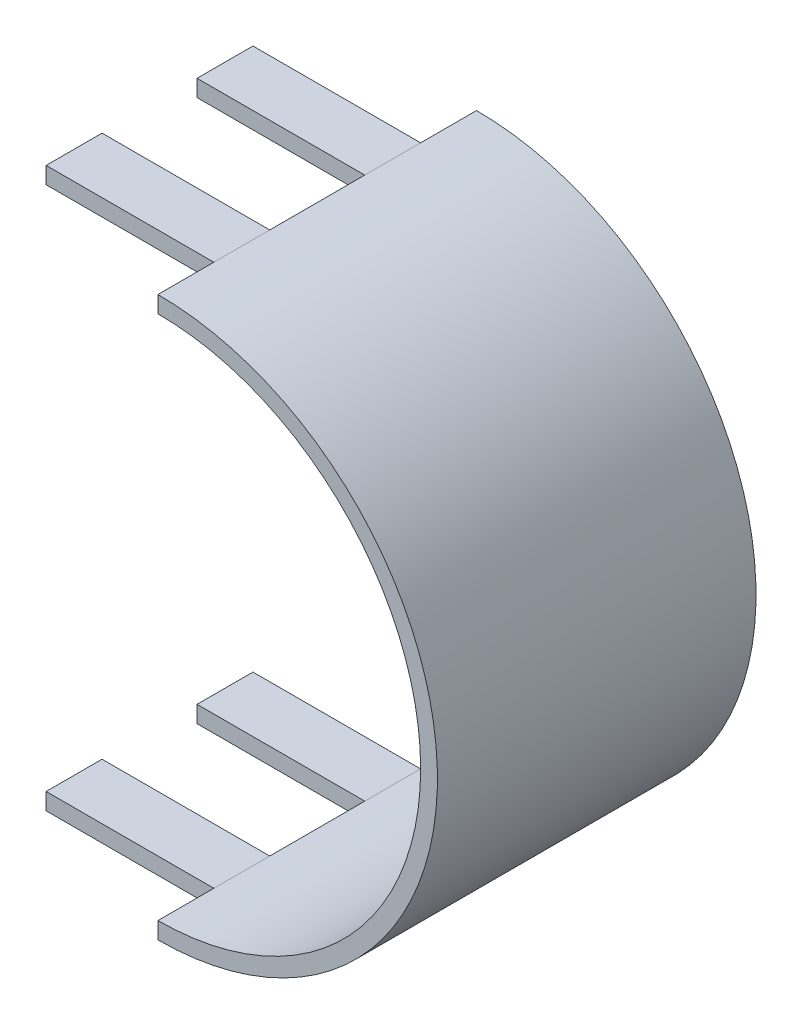
ISO-10303-21;
HEADER;
FILE_DESCRIPTION(('STEP AP214'),'2;1');
FILE_NAME('part.step','',(''),(''),'','','');
FILE_SCHEMA(('AUTOMOTIVE_DESIGN { 1 0 10303 214 1 1 1 1 }'));
ENDSEC;
DATA;
#1=APPLICATION_CONTEXT('core data for automotive mechanical design processes');
#2=APPLICATION_PROTOCOL_DEFINITION('international standard','automotive_design',2000,#1);
#3=PRODUCT_CONTEXT('',#1,'mechanical');
#4=PRODUCT('Part','Part','',(#3));
#5=PRODUCT_RELATED_PRODUCT_CATEGORY('part','',(#4));
#6=PRODUCT_DEFINITION_FORMATION('','',#4);
#7=PRODUCT_DEFINITION_CONTEXT('part definition',#1,'design');
#8=PRODUCT_DEFINITION('design','',#6,#7);
#9=PRODUCT_DEFINITION_SHAPE('','',#8);
#10=(LENGTH_UNIT() NAMED_UNIT(*) SI_UNIT(.MILLI.,.METRE.));
#11=(NAMED_UNIT(*) PLANE_ANGLE_UNIT() SI_UNIT($,.RADIAN.));
#12=(NAMED_UNIT(*) SI_UNIT($,.STERADIAN.) SOLID_ANGLE_UNIT());
#13=UNCERTAINTY_MEASURE_WITH_UNIT(LENGTH_MEASURE(1.E-05),#10,'distance_accuracy_value','');
#14=(GEOMETRIC_REPRESENTATION_CONTEXT(3) GLOBAL_UNCERTAINTY_ASSIGNED_CONTEXT((#13)) GLOBAL_UNIT_ASSIGNED_CONTEXT((#10,
#11,#12)) REPRESENTATION_CONTEXT('',''));
#15=CARTESIAN_POINT('',(0.,0.,0.));
#16=DIRECTION('',(0.,0.,1.));
#17=DIRECTION('',(1.,0.,0.));
#18=AXIS2_PLACEMENT_3D('',#15,#16,#17);
#19=CARTESIAN_POINT('',(300.,0.,60.));
#20=DIRECTION('',(0.,0.,-1.));
#21=DIRECTION('',(-1.,0.,0.));
#22=AXIS2_PLACEMENT_3D('',#19,#20,#21);
#23=CYLINDRICAL_SURFACE('',#22,50.);
#24=DIRECTION('',(0.,0.,-1.));
#25=VECTOR('',#24,1.);
#26=CARTESIAN_POINT('',(300.,-50.,60.));
#27=LINE('',#26,#25);
#28=CARTESIAN_POINT('',(300.,-50.,60.));
#29=VERTEX_POINT('',#28);
#30=CARTESIAN_POINT('',(300.,-50.,50.));
#31=VERTEX_POINT('',#30);
#32=EDGE_CURVE('E313',#29,#31,#27,.T.);
#33=ORIENTED_EDGE('',*,*,#32,.T.);
#34=DIRECTION('',(0.,0.,-1.));
#35=VECTOR('',#34,1.);
#36=CARTESIAN_POINT('',(300.,-50.,60.));
#37=LINE('',#36,#35);
#38=CARTESIAN_POINT('',(300.,-50.,40.));
#39=VERTEX_POINT('',#38);
#40=EDGE_CURVE('E249',#31,#39,#37,.T.);
#41=ORIENTED_EDGE('',*,*,#40,.T.);
#42=CARTESIAN_POINT('',(300.,-50.,23.));
#43=VERTEX_POINT('',#42);
#44=EDGE_CURVE('E323',#39,#43,#27,.T.);
#45=ORIENTED_EDGE('',*,*,#44,.T.);
#46=DIRECTION('',(0.,0.,-1.));
#47=VECTOR('',#46,1.);
#48=CARTESIAN_POINT('',(300.,-50.,60.));
#49=LINE('',#48,#47);
#50=CARTESIAN_POINT('',(300.,-50.,13.));
#51=VERTEX_POINT('',#50);
#52=EDGE_CURVE('E211',#43,#51,#49,.T.);
#53=ORIENTED_EDGE('',*,*,#52,.T.);
#54=CARTESIAN_POINT('',(300.,-50.,3.));
#55=VERTEX_POINT('',#54);
#56=EDGE_CURVE('E324',#51,#55,#27,.T.);
#57=ORIENTED_EDGE('',*,*,#56,.T.);
#58=CARTESIAN_POINT('',(300.,0.,3.));
#59=DIRECTION('',(0.,0.,1.));
#60=DIRECTION('',(1.,0.,0.));
#61=AXIS2_PLACEMENT_3D('',#58,#59,#60);
#62=CIRCLE('',#61,50.);
#63=CARTESIAN_POINT('',(300.,50.,3.));
#64=VERTEX_POINT('',#63);
#65=EDGE_CURVE('E317',#55,#64,#62,.T.);
#66=ORIENTED_EDGE('',*,*,#65,.T.);
#67=DIRECTION('',(0.,0.,-1.));
#68=VECTOR('',#67,1.);
#69=CARTESIAN_POINT('',(300.,50.,60.));
#70=LINE('',#69,#68);
#71=CARTESIAN_POINT('',(300.,50.,13.));
#72=VERTEX_POINT('',#71);
#73=EDGE_CURVE('E181',#72,#64,#70,.T.);
#74=ORIENTED_EDGE('',*,*,#73,.F.);
#75=DIRECTION('',(0.,0.,-1.));
#76=VECTOR('',#75,1.);
#77=CARTESIAN_POINT('',(300.,50.,60.));
#78=LINE('',#77,#76);
#79=CARTESIAN_POINT('',(300.,50.,23.));
#80=VERTEX_POINT('',#79);
#81=EDGE_CURVE('E185',#80,#72,#78,.T.);
#82=ORIENTED_EDGE('',*,*,#81,.F.);
#83=CARTESIAN_POINT('',(300.,50.,40.));
#84=VERTEX_POINT('',#83);
#85=EDGE_CURVE('E172',#84,#80,#70,.T.);
#86=ORIENTED_EDGE('',*,*,#85,.F.);
#87=DIRECTION('',(0.,0.,-1.));
#88=VECTOR('',#87,1.);
#89=CARTESIAN_POINT('',(300.,50.,60.));
#90=LINE('',#89,#88);
#91=CARTESIAN_POINT('',(300.,50.,50.));
#92=VERTEX_POINT('',#91);
#93=EDGE_CURVE('E287',#92,#84,#90,.T.);
#94=ORIENTED_EDGE('',*,*,#93,.F.);
#95=CARTESIAN_POINT('',(300.,50.,60.));
#96=VERTEX_POINT('',#95);
#97=EDGE_CURVE('E180',#96,#92,#70,.T.);
#98=ORIENTED_EDGE('',*,*,#97,.F.);
#99=CARTESIAN_POINT('',(300.,0.,60.));
#100=DIRECTION('',(0.,0.,1.));
#101=DIRECTION('',(1.,0.,0.));
#102=AXIS2_PLACEMENT_3D('',#99,#100,#101);
#103=CIRCLE('',#102,50.);
#104=EDGE_CURVE('E310',#29,#96,#103,.T.);
#105=ORIENTED_EDGE('',*,*,#104,.F.);
#106=EDGE_LOOP('',(#33,#41,#45,#53,#57,#66,#74,#82,#86,#94,#98,#105));
#107=FACE_BOUND('',#106,.T.);
#108=ADVANCED_FACE('F34',(#107),#23,.T.);
#109=CARTESIAN_POINT('',(300.,47.,3.));
#110=DIRECTION('',(0.,1.,0.));
#111=DIRECTION('',(0.,0.,1.));
#112=AXIS2_PLACEMENT_3D('',#109,#110,#111);
#113=PLANE('',#112);
#114=DIRECTION('',(-1.,0.,0.));
#115=VECTOR('',#114,1.);
#116=CARTESIAN_POINT('',(300.,47.,13.));
#117=LINE('',#116,#115);
#118=CARTESIAN_POINT('',(300.,47.,13.));
#119=VERTEX_POINT('',#118);
#120=CARTESIAN_POINT('',(270.,47.,13.));
#121=VERTEX_POINT('',#120);
#122=EDGE_CURVE('E192',#119,#121,#117,.T.);
#123=ORIENTED_EDGE('',*,*,#122,.F.);
#124=DIRECTION('',(0.,0.,1.));
#125=VECTOR('',#124,1.);
#126=CARTESIAN_POINT('',(300.,47.,3.));
#127=LINE('',#126,#125);
#128=CARTESIAN_POINT('',(300.,47.,23.));
#129=VERTEX_POINT('',#128);
#130=EDGE_CURVE('E58',#119,#129,#127,.T.);
#131=ORIENTED_EDGE('',*,*,#130,.T.);
#132=DIRECTION('',(1.,0.,0.));
#133=VECTOR('',#132,1.);
#134=CARTESIAN_POINT('',(300.,47.,23.));
#135=LINE('',#134,#133);
#136=CARTESIAN_POINT('',(270.,47.,23.));
#137=VERTEX_POINT('',#136);
#138=EDGE_CURVE('E206',#137,#129,#135,.T.);
#139=ORIENTED_EDGE('',*,*,#138,.F.);
#140=DIRECTION('',(0.,0.,1.));
#141=VECTOR('',#140,1.);
#142=CARTESIAN_POINT('',(270.,47.,3.));
#143=LINE('',#142,#141);
#144=EDGE_CURVE('E498',#121,#137,#143,.T.);
#145=ORIENTED_EDGE('',*,*,#144,.F.);
#146=EDGE_LOOP('',(#123,#131,#139,#145));
#147=FACE_BOUND('',#146,.T.);
#148=ADVANCED_FACE('F399',(#147),#113,.F.);
#149=CARTESIAN_POINT('',(300.,47.,3.));
#150=DIRECTION('',(0.,1.,0.));
#151=DIRECTION('',(0.,0.,1.));
#152=AXIS2_PLACEMENT_3D('',#149,#150,#151);
#153=PLANE('',#152);
#154=DIRECTION('',(-1.,0.,0.));
#155=VECTOR('',#154,1.);
#156=CARTESIAN_POINT('',(300.,47.,40.));
#157=LINE('',#156,#155);
#158=CARTESIAN_POINT('',(300.,47.,40.));
#159=VERTEX_POINT('',#158);
#160=CARTESIAN_POINT('',(270.,47.,40.));
#161=VERTEX_POINT('',#160);
#162=EDGE_CURVE('E289',#159,#161,#157,.T.);
#163=ORIENTED_EDGE('',*,*,#162,.F.);
#164=DIRECTION('',(0.,0.,1.));
#165=VECTOR('',#164,1.);
#166=CARTESIAN_POINT('',(300.,47.,3.));
#167=LINE('',#166,#165);
#168=CARTESIAN_POINT('',(300.,47.,50.));
#169=VERTEX_POINT('',#168);
#170=EDGE_CURVE('E282',#159,#169,#167,.T.);
#171=ORIENTED_EDGE('',*,*,#170,.T.);
#172=DIRECTION('',(1.,0.,0.));
#173=VECTOR('',#172,1.);
#174=CARTESIAN_POINT('',(300.,47.,50.));
#175=LINE('',#174,#173);
#176=CARTESIAN_POINT('',(270.,47.,50.));
#177=VERTEX_POINT('',#176);
#178=EDGE_CURVE('E295',#177,#169,#175,.T.);
#179=ORIENTED_EDGE('',*,*,#178,.F.);
#180=DIRECTION('',(0.,0.,1.));
#181=VECTOR('',#180,1.);
#182=CARTESIAN_POINT('',(270.,47.,3.));
#183=LINE('',#182,#181);
#184=EDGE_CURVE('E292',#161,#177,#183,.T.);
#185=ORIENTED_EDGE('',*,*,#184,.F.);
#186=EDGE_LOOP('',(#163,#171,#179,#185));
#187=FACE_BOUND('',#186,.T.);
#188=ADVANCED_FACE('F382',(#187),#153,.F.);
#189=CARTESIAN_POINT('',(-300.,-47.,3.));
#190=DIRECTION('',(0.,-1.,0.));
#191=DIRECTION('',(0.,0.,-1.));
#192=AXIS2_PLACEMENT_3D('',#189,#190,#191);
#193=PLANE('',#192);
#194=DIRECTION('',(1.,0.,0.));
#195=VECTOR('',#194,1.);
#196=CARTESIAN_POINT('',(-300.,-47.,40.));
#197=LINE('',#196,#195);
#198=CARTESIAN_POINT('',(270.,-47.,40.));
#199=VERTEX_POINT('',#198);
#200=CARTESIAN_POINT('',(300.,-47.,40.));
#201=VERTEX_POINT('',#200);
#202=EDGE_CURVE('E264',#199,#201,#197,.T.);
#203=ORIENTED_EDGE('',*,*,#202,.F.);
#204=DIRECTION('',(0.,0.,-1.));
#205=VECTOR('',#204,1.);
#206=CARTESIAN_POINT('',(270.,-47.,3.));
#207=LINE('',#206,#205);
#208=CARTESIAN_POINT('',(270.,-47.,50.));
#209=VERTEX_POINT('',#208);
#210=EDGE_CURVE('E261',#209,#199,#207,.T.);
#211=ORIENTED_EDGE('',*,*,#210,.F.);
#212=DIRECTION('',(-1.,0.,0.));
#213=VECTOR('',#212,1.);
#214=CARTESIAN_POINT('',(-300.,-47.,50.));
#215=LINE('',#214,#213);
#216=CARTESIAN_POINT('',(300.,-47.,50.));
#217=VERTEX_POINT('',#216);
#218=EDGE_CURVE('E260',#217,#209,#215,.T.);
#219=ORIENTED_EDGE('',*,*,#218,.F.);
#220=DIRECTION('',(0.,0.,1.));
#221=VECTOR('',#220,1.);
#222=CARTESIAN_POINT('',(300.,-47.,3.));
#223=LINE('',#222,#221);
#224=EDGE_CURVE('E246',#201,#217,#223,.T.);
#225=ORIENTED_EDGE('',*,*,#224,.F.);
#226=EDGE_LOOP('',(#203,#211,#219,#225));
#227=FACE_BOUND('',#226,.T.);
#228=ADVANCED_FACE('F436',(#227),#193,.F.);
#229=CARTESIAN_POINT('',(-300.,-47.,3.));
#230=DIRECTION('',(0.,-1.,0.));
#231=DIRECTION('',(0.,0.,-1.));
#232=AXIS2_PLACEMENT_3D('',#229,#230,#231);
#233=PLANE('',#232);
#234=DIRECTION('',(1.,0.,0.));
#235=VECTOR('',#234,1.);
#236=CARTESIAN_POINT('',(-300.,-47.,13.));
#237=LINE('',#236,#235);
#238=CARTESIAN_POINT('',(270.,-47.,13.));
#239=VERTEX_POINT('',#238);
#240=CARTESIAN_POINT('',(300.,-47.,13.));
#241=VERTEX_POINT('',#240);
#242=EDGE_CURVE('E231',#239,#241,#237,.T.);
#243=ORIENTED_EDGE('',*,*,#242,.F.);
#244=DIRECTION('',(0.,0.,-1.));
#245=VECTOR('',#244,1.);
#246=CARTESIAN_POINT('',(270.,-47.,3.));
#247=LINE('',#246,#245);
#248=CARTESIAN_POINT('',(270.,-47.,23.));
#249=VERTEX_POINT('',#248);
#250=EDGE_CURVE('E228',#249,#239,#247,.T.);
#251=ORIENTED_EDGE('',*,*,#250,.F.);
#252=DIRECTION('',(-1.,0.,0.));
#253=VECTOR('',#252,1.);
#254=CARTESIAN_POINT('',(-300.,-47.,23.));
#255=LINE('',#254,#253);
#256=CARTESIAN_POINT('',(300.,-47.,23.));
#257=VERTEX_POINT('',#256);
#258=EDGE_CURVE('E225',#257,#249,#255,.T.);
#259=ORIENTED_EDGE('',*,*,#258,.F.);
#260=DIRECTION('',(0.,0.,1.));
#261=VECTOR('',#260,1.);
#262=CARTESIAN_POINT('',(300.,-47.,3.));
#263=LINE('',#262,#261);
#264=EDGE_CURVE('E215',#241,#257,#263,.T.);
#265=ORIENTED_EDGE('',*,*,#264,.F.);
#266=EDGE_LOOP('',(#243,#251,#259,#265));
#267=FACE_BOUND('',#266,.T.);
#268=ADVANCED_FACE('F348',(#267),#233,.F.);
#269=CARTESIAN_POINT('',(270.,-50.01,13.));
#270=DIRECTION('',(-1.,0.,0.));
#271=DIRECTION('',(0.,0.,1.));
#272=AXIS2_PLACEMENT_3D('',#269,#270,#271);
#273=PLANE('',#272);
#274=DIRECTION('',(0.,1.,0.));
#275=VECTOR('',#274,1.);
#276=CARTESIAN_POINT('',(270.,-50.01,13.));
#277=LINE('',#276,#275);
#278=CARTESIAN_POINT('',(270.,-50.,13.));
#279=VERTEX_POINT('',#278);
#280=EDGE_CURVE('E214',#279,#239,#277,.T.);
#281=ORIENTED_EDGE('',*,*,#280,.F.);
#282=DIRECTION('',(0.,0.,1.));
#283=VECTOR('',#282,1.);
#284=CARTESIAN_POINT('',(270.,-50.,60.));
#285=LINE('',#284,#283);
#286=CARTESIAN_POINT('',(270.,-50.,23.));
#287=VERTEX_POINT('',#286);
#288=EDGE_CURVE('E237',#279,#287,#285,.T.);
#289=ORIENTED_EDGE('',*,*,#288,.T.);
#290=DIRECTION('',(0.,1.,0.));
#291=VECTOR('',#290,1.);
#292=CARTESIAN_POINT('',(270.,-50.01,23.));
#293=LINE('',#292,#291);
#294=EDGE_CURVE('E243',#287,#249,#293,.T.);
#295=ORIENTED_EDGE('',*,*,#294,.T.);
#296=ORIENTED_EDGE('',*,*,#250,.T.);
#297=EDGE_LOOP('',(#281,#289,#295,#296));
#298=FACE_BOUND('',#297,.T.);
#299=ADVANCED_FACE('F469',(#298),#273,.T.);
#300=CARTESIAN_POINT('',(300.,-50.01,23.));
#301=DIRECTION('',(0.,0.,1.));
#302=DIRECTION('',(1.,0.,0.));
#303=AXIS2_PLACEMENT_3D('',#300,#301,#302);
#304=PLANE('',#303);
#305=ORIENTED_EDGE('',*,*,#294,.F.);
#306=DIRECTION('',(1.,0.,0.));
#307=VECTOR('',#306,1.);
#308=CARTESIAN_POINT('',(-300.,-50.,23.));
#309=LINE('',#308,#307);
#310=EDGE_CURVE('E234',#287,#43,#309,.T.);
#311=ORIENTED_EDGE('',*,*,#310,.T.);
#312=DIRECTION('',(0.,1.,0.));
#313=VECTOR('',#312,1.);
#314=CARTESIAN_POINT('',(300.,1.71683972880179E-13,23.));
#315=LINE('',#314,#313);
#316=EDGE_CURVE('E218',#43,#257,#315,.T.);
#317=ORIENTED_EDGE('',*,*,#316,.T.);
#318=ORIENTED_EDGE('',*,*,#258,.T.);
#319=EDGE_LOOP('',(#305,#311,#317,#318));
#320=FACE_BOUND('',#319,.T.);
#321=ADVANCED_FACE('F432',(#320),#304,.T.);
#322=CARTESIAN_POINT('',(300.,-50.01,13.));
#323=DIRECTION('',(0.,0.,-1.));
#324=DIRECTION('',(-1.,0.,0.));
#325=AXIS2_PLACEMENT_3D('',#322,#323,#324);
#326=PLANE('',#325);
#327=DIRECTION('',(0.,-1.,0.));
#328=VECTOR('',#327,1.);
#329=CARTESIAN_POINT('',(300.,1.71683972880179E-13,13.));
#330=LINE('',#329,#328);
#331=EDGE_CURVE('E221',#241,#51,#330,.T.);
#332=ORIENTED_EDGE('',*,*,#331,.T.);
#333=DIRECTION('',(-1.,0.,0.));
#334=VECTOR('',#333,1.);
#335=CARTESIAN_POINT('',(-300.,-50.,13.));
#336=LINE('',#335,#334);
#337=EDGE_CURVE('E217',#51,#279,#336,.T.);
#338=ORIENTED_EDGE('',*,*,#337,.T.);
#339=ORIENTED_EDGE('',*,*,#280,.T.);
#340=ORIENTED_EDGE('',*,*,#242,.T.);
#341=EDGE_LOOP('',(#332,#338,#339,#340));
#342=FACE_BOUND('',#341,.T.);
#343=ADVANCED_FACE('F343',(#342),#326,.T.);
#344=CARTESIAN_POINT('',(-300.,-50.,60.));
#345=DIRECTION('',(0.,1.,0.));
#346=DIRECTION('',(0.,0.,1.));
#347=AXIS2_PLACEMENT_3D('',#344,#345,#346);
#348=PLANE('',#347);
#349=ORIENTED_EDGE('',*,*,#337,.F.);
#350=ORIENTED_EDGE('',*,*,#52,.F.);
#351=ORIENTED_EDGE('',*,*,#310,.F.);
#352=ORIENTED_EDGE('',*,*,#288,.F.);
#353=EDGE_LOOP('',(#349,#350,#351,#352));
#354=FACE_BOUND('',#353,.T.);
#355=ADVANCED_FACE('F420',(#354),#348,.F.);
#356=CARTESIAN_POINT('',(300.,1.71683972880179E-13,0.));
#357=DIRECTION('',(-1.,0.,0.));
#358=DIRECTION('',(0.,-1.,0.));
#359=AXIS2_PLACEMENT_3D('',#356,#357,#358);
#360=PLANE('',#359);
#361=ORIENTED_EDGE('',*,*,#331,.F.);
#362=DIRECTION('',(0.,0.,1.));
#363=VECTOR('',#362,1.);
#364=CARTESIAN_POINT('',(300.,-47.,3.));
#365=LINE('',#364,#363);
#366=CARTESIAN_POINT('',(300.,-47.,3.));
#367=VERTEX_POINT('',#366);
#368=EDGE_CURVE('E318',#367,#241,#365,.T.);
#369=ORIENTED_EDGE('',*,*,#368,.F.);
#370=DIRECTION('',(0.,1.,0.));
#371=VECTOR('',#370,1.);
#372=CARTESIAN_POINT('',(300.,1.71683972880179E-13,3.));
#373=LINE('',#372,#371);
#374=EDGE_CURVE('E11',#55,#367,#373,.T.);
#375=ORIENTED_EDGE('',*,*,#374,.F.);
#376=ORIENTED_EDGE('',*,*,#56,.F.);
#377=EDGE_LOOP('',(#361,#369,#375,#376));
#378=FACE_BOUND('',#377,.T.);
#379=ADVANCED_FACE('F341',(#378),#360,.T.);
#380=CARTESIAN_POINT('',(0.,0.,3.));
#381=DIRECTION('',(0.,0.,1.));
#382=DIRECTION('',(1.,0.,0.));
#383=AXIS2_PLACEMENT_3D('',#380,#381,#382);
#384=PLANE('',#383);
#385=DIRECTION('',(0.,1.,0.));
#386=VECTOR('',#385,1.);
#387=CARTESIAN_POINT('',(300.,1.71683972880179E-13,3.));
#388=LINE('',#387,#386);
#389=CARTESIAN_POINT('',(300.,47.,3.));
#390=VERTEX_POINT('',#389);
#391=EDGE_CURVE('E43',#390,#64,#388,.T.);
#392=ORIENTED_EDGE('',*,*,#391,.T.);
#393=ORIENTED_EDGE('',*,*,#65,.F.);
#394=ORIENTED_EDGE('',*,*,#374,.T.);
#395=CARTESIAN_POINT('',(300.,0.,3.));
#396=DIRECTION('',(0.,0.,1.));
#397=DIRECTION('',(1.,0.,0.));
#398=AXIS2_PLACEMENT_3D('',#395,#396,#397);
#399=CIRCLE('',#398,47.);
#400=EDGE_CURVE('E38',#390,#367,#399,.F.);
#401=ORIENTED_EDGE('',*,*,#400,.F.);
#402=EDGE_LOOP('',(#392,#393,#394,#401));
#403=FACE_BOUND('',#402,.T.);
#404=ADVANCED_FACE('F36',(#403),#384,.F.);
#405=CARTESIAN_POINT('',(300.,0.,3.));
#406=DIRECTION('',(0.,0.,1.));
#407=DIRECTION('',(1.,0.,0.));
#408=AXIS2_PLACEMENT_3D('',#405,#406,#407);
#409=CYLINDRICAL_SURFACE('',#408,47.);
#410=DIRECTION('',(0.,0.,1.));
#411=VECTOR('',#410,1.);
#412=CARTESIAN_POINT('',(300.,47.,3.));
#413=LINE('',#412,#411);
#414=EDGE_CURVE('E325',#390,#119,#413,.T.);
#415=ORIENTED_EDGE('',*,*,#414,.F.);
#416=ORIENTED_EDGE('',*,*,#400,.T.);
#417=ORIENTED_EDGE('',*,*,#368,.T.);
#418=ORIENTED_EDGE('',*,*,#264,.T.);
#419=EDGE_CURVE('E321',#257,#201,#365,.T.);
#420=ORIENTED_EDGE('',*,*,#419,.T.);
#421=ORIENTED_EDGE('',*,*,#224,.T.);
#422=CARTESIAN_POINT('',(300.,-47.,60.));
#423=VERTEX_POINT('',#422);
#424=EDGE_CURVE('E312',#217,#423,#365,.T.);
#425=ORIENTED_EDGE('',*,*,#424,.T.);
#426=CARTESIAN_POINT('',(300.,0.,60.));
#427=DIRECTION('',(0.,0.,1.));
#428=DIRECTION('',(1.,0.,0.));
#429=AXIS2_PLACEMENT_3D('',#426,#427,#428);
#430=CIRCLE('',#429,47.);
#431=CARTESIAN_POINT('',(300.,47.,60.));
#432=VERTEX_POINT('',#431);
#433=EDGE_CURVE('E314',#423,#432,#430,.T.);
#434=ORIENTED_EDGE('',*,*,#433,.T.);
#435=EDGE_CURVE('E284',#169,#432,#413,.T.);
#436=ORIENTED_EDGE('',*,*,#435,.F.);
#437=ORIENTED_EDGE('',*,*,#170,.F.);
#438=EDGE_CURVE('E326',#129,#159,#413,.T.);
#439=ORIENTED_EDGE('',*,*,#438,.F.);
#440=ORIENTED_EDGE('',*,*,#130,.F.);
#441=EDGE_LOOP('',(#415,#416,#417,#418,#420,#421,#425,#434,#436,#437,#439,#440));
#442=FACE_BOUND('',#441,.T.);
#443=ADVANCED_FACE('F336',(#442),#409,.F.);
#444=CARTESIAN_POINT('',(-300.,0.,60.));
#445=DIRECTION('',(0.,0.,1.));
#446=DIRECTION('',(1.,0.,0.));
#447=AXIS2_PLACEMENT_3D('',#444,#445,#446);
#448=PLANE('',#447);
#449=ORIENTED_EDGE('',*,*,#104,.T.);
#450=DIRECTION('',(0.,-1.,0.));
#451=VECTOR('',#450,1.);
#452=CARTESIAN_POINT('',(300.,3.43367945760358E-13,60.));
#453=LINE('',#452,#451);
#454=EDGE_CURVE('E328',#96,#432,#453,.T.);
#455=ORIENTED_EDGE('',*,*,#454,.T.);
#456=ORIENTED_EDGE('',*,*,#433,.F.);
#457=EDGE_CURVE('E331',#423,#29,#453,.T.);
#458=ORIENTED_EDGE('',*,*,#457,.T.);
#459=EDGE_LOOP('',(#449,#455,#456,#458));
#460=FACE_BOUND('',#459,.T.);
#461=ADVANCED_FACE('F366',(#460),#448,.T.);
#462=CARTESIAN_POINT('',(270.,-50.01,40.));
#463=DIRECTION('',(-1.,0.,0.));
#464=DIRECTION('',(0.,0.,1.));
#465=AXIS2_PLACEMENT_3D('',#462,#463,#464);
#466=PLANE('',#465);
#467=DIRECTION('',(0.,1.,0.));
#468=VECTOR('',#467,1.);
#469=CARTESIAN_POINT('',(270.,-50.01,40.));
#470=LINE('',#469,#468);
#471=CARTESIAN_POINT('',(270.,-50.,40.));
#472=VERTEX_POINT('',#471);
#473=EDGE_CURVE('E252',#472,#199,#470,.T.);
#474=ORIENTED_EDGE('',*,*,#473,.F.);
#475=DIRECTION('',(0.,0.,1.));
#476=VECTOR('',#475,1.);
#477=CARTESIAN_POINT('',(270.,-50.,60.));
#478=LINE('',#477,#476);
#479=CARTESIAN_POINT('',(270.,-50.,50.));
#480=VERTEX_POINT('',#479);
#481=EDGE_CURVE('E272',#472,#480,#478,.T.);
#482=ORIENTED_EDGE('',*,*,#481,.T.);
#483=DIRECTION('',(0.,1.,0.));
#484=VECTOR('',#483,1.);
#485=CARTESIAN_POINT('',(270.,-50.01,50.));
#486=LINE('',#485,#484);
#487=EDGE_CURVE('E245',#480,#209,#486,.T.);
#488=ORIENTED_EDGE('',*,*,#487,.T.);
#489=ORIENTED_EDGE('',*,*,#210,.T.);
#490=EDGE_LOOP('',(#474,#482,#488,#489));
#491=FACE_BOUND('',#490,.T.);
#492=ADVANCED_FACE('F448',(#491),#466,.T.);
#493=CARTESIAN_POINT('',(300.,-50.01,50.));
#494=DIRECTION('',(0.,0.,1.));
#495=DIRECTION('',(1.,0.,0.));
#496=AXIS2_PLACEMENT_3D('',#493,#494,#495);
#497=PLANE('',#496);
#498=ORIENTED_EDGE('',*,*,#487,.F.);
#499=DIRECTION('',(1.,0.,0.));
#500=VECTOR('',#499,1.);
#501=CARTESIAN_POINT('',(-300.,-50.,50.));
#502=LINE('',#501,#500);
#503=EDGE_CURVE('E269',#480,#31,#502,.T.);
#504=ORIENTED_EDGE('',*,*,#503,.T.);
#505=DIRECTION('',(0.,1.,0.));
#506=VECTOR('',#505,1.);
#507=CARTESIAN_POINT('',(300.,1.71683972880179E-13,50.));
#508=LINE('',#507,#506);
#509=EDGE_CURVE('E253',#31,#217,#508,.T.);
#510=ORIENTED_EDGE('',*,*,#509,.T.);
#511=ORIENTED_EDGE('',*,*,#218,.T.);
#512=EDGE_LOOP('',(#498,#504,#510,#511));
#513=FACE_BOUND('',#512,.T.);
#514=ADVANCED_FACE('F445',(#513),#497,.T.);
#515=CARTESIAN_POINT('',(300.,-50.01,40.));
#516=DIRECTION('',(0.,0.,-1.));
#517=DIRECTION('',(-1.,0.,0.));
#518=AXIS2_PLACEMENT_3D('',#515,#516,#517);
#519=PLANE('',#518);
#520=DIRECTION('',(0.,-1.,0.));
#521=VECTOR('',#520,1.);
#522=CARTESIAN_POINT('',(300.,1.71683972880179E-13,40.));
#523=LINE('',#522,#521);
#524=EDGE_CURVE('E257',#201,#39,#523,.T.);
#525=ORIENTED_EDGE('',*,*,#524,.T.);
#526=DIRECTION('',(-1.,0.,0.));
#527=VECTOR('',#526,1.);
#528=CARTESIAN_POINT('',(-300.,-50.,40.));
#529=LINE('',#528,#527);
#530=EDGE_CURVE('E248',#39,#472,#529,.T.);
#531=ORIENTED_EDGE('',*,*,#530,.T.);
#532=ORIENTED_EDGE('',*,*,#473,.T.);
#533=ORIENTED_EDGE('',*,*,#202,.T.);
#534=EDGE_LOOP('',(#525,#531,#532,#533));
#535=FACE_BOUND('',#534,.T.);
#536=ADVANCED_FACE('F443',(#535),#519,.T.);
#537=CARTESIAN_POINT('',(-300.,-50.,60.));
#538=DIRECTION('',(0.,1.,0.));
#539=DIRECTION('',(0.,0.,1.));
#540=AXIS2_PLACEMENT_3D('',#537,#538,#539);
#541=PLANE('',#540);
#542=ORIENTED_EDGE('',*,*,#530,.F.);
#543=ORIENTED_EDGE('',*,*,#40,.F.);
#544=ORIENTED_EDGE('',*,*,#503,.F.);
#545=ORIENTED_EDGE('',*,*,#481,.F.);
#546=EDGE_LOOP('',(#542,#543,#544,#545));
#547=FACE_BOUND('',#546,.T.);
#548=ADVANCED_FACE('F440',(#547),#541,.F.);
#549=ORIENTED_EDGE('',*,*,#509,.F.);
#550=ORIENTED_EDGE('',*,*,#32,.F.);
#551=ORIENTED_EDGE('',*,*,#457,.F.);
#552=ORIENTED_EDGE('',*,*,#424,.F.);
#553=EDGE_LOOP('',(#549,#550,#551,#552));
#554=FACE_BOUND('',#553,.T.);
#555=ADVANCED_FACE('F363',(#554),#360,.T.);
#556=CARTESIAN_POINT('',(300.,46.99,50.));
#557=DIRECTION('',(0.,0.,1.));
#558=DIRECTION('',(1.,0.,0.));
#559=AXIS2_PLACEMENT_3D('',#556,#557,#558);
#560=PLANE('',#559);
#561=DIRECTION('',(0.,1.,0.));
#562=VECTOR('',#561,1.);
#563=CARTESIAN_POINT('',(270.,46.99,50.));
#564=LINE('',#563,#562);
#565=CARTESIAN_POINT('',(270.,50.,50.));
#566=VERTEX_POINT('',#565);
#567=EDGE_CURVE('E281',#177,#566,#564,.T.);
#568=ORIENTED_EDGE('',*,*,#567,.F.);
#569=ORIENTED_EDGE('',*,*,#178,.T.);
#570=DIRECTION('',(0.,1.,0.));
#571=VECTOR('',#570,1.);
#572=CARTESIAN_POINT('',(300.,1.71683972880179E-13,50.));
#573=LINE('',#572,#571);
#574=EDGE_CURVE('E256',#169,#92,#573,.T.);
#575=ORIENTED_EDGE('',*,*,#574,.T.);
#576=DIRECTION('',(-1.,0.,0.));
#577=VECTOR('',#576,1.);
#578=CARTESIAN_POINT('',(-300.,50.,50.));
#579=LINE('',#578,#577);
#580=EDGE_CURVE('E304',#92,#566,#579,.T.);
#581=ORIENTED_EDGE('',*,*,#580,.T.);
#582=EDGE_LOOP('',(#568,#569,#575,#581));
#583=FACE_BOUND('',#582,.T.);
#584=ADVANCED_FACE('F377',(#583),#560,.T.);
#585=CARTESIAN_POINT('',(270.,46.99,40.));
#586=DIRECTION('',(-1.,0.,0.));
#587=DIRECTION('',(0.,0.,1.));
#588=AXIS2_PLACEMENT_3D('',#585,#586,#587);
#589=PLANE('',#588);
#590=DIRECTION('',(0.,1.,0.));
#591=VECTOR('',#590,1.);
#592=CARTESIAN_POINT('',(270.,46.99,40.));
#593=LINE('',#592,#591);
#594=CARTESIAN_POINT('',(270.,50.,40.));
#595=VERTEX_POINT('',#594);
#596=EDGE_CURVE('E279',#161,#595,#593,.T.);
#597=ORIENTED_EDGE('',*,*,#596,.F.);
#598=ORIENTED_EDGE('',*,*,#184,.T.);
#599=ORIENTED_EDGE('',*,*,#567,.T.);
#600=DIRECTION('',(0.,0.,-1.));
#601=VECTOR('',#600,1.);
#602=CARTESIAN_POINT('',(270.,50.,60.));
#603=LINE('',#602,#601);
#604=EDGE_CURVE('E301',#566,#595,#603,.T.);
#605=ORIENTED_EDGE('',*,*,#604,.T.);
#606=EDGE_LOOP('',(#597,#598,#599,#605));
#607=FACE_BOUND('',#606,.T.);
#608=ADVANCED_FACE('F387',(#607),#589,.T.);
#609=CARTESIAN_POINT('',(300.,46.99,40.));
#610=DIRECTION('',(0.,0.,-1.));
#611=DIRECTION('',(-1.,0.,0.));
#612=AXIS2_PLACEMENT_3D('',#609,#610,#611);
#613=PLANE('',#612);
#614=DIRECTION('',(0.,-1.,0.));
#615=VECTOR('',#614,1.);
#616=CARTESIAN_POINT('',(300.,1.71683972880179E-13,40.));
#617=LINE('',#616,#615);
#618=EDGE_CURVE('E176',#84,#159,#617,.T.);
#619=ORIENTED_EDGE('',*,*,#618,.T.);
#620=ORIENTED_EDGE('',*,*,#162,.T.);
#621=ORIENTED_EDGE('',*,*,#596,.T.);
#622=DIRECTION('',(1.,0.,0.));
#623=VECTOR('',#622,1.);
#624=CARTESIAN_POINT('',(-300.,50.,40.));
#625=LINE('',#624,#623);
#626=EDGE_CURVE('E298',#595,#84,#625,.T.);
#627=ORIENTED_EDGE('',*,*,#626,.T.);
#628=EDGE_LOOP('',(#619,#620,#621,#627));
#629=FACE_BOUND('',#628,.T.);
#630=ADVANCED_FACE('F385',(#629),#613,.T.);
#631=CARTESIAN_POINT('',(-300.,50.,60.));
#632=DIRECTION('',(0.,-1.,0.));
#633=DIRECTION('',(0.,0.,-1.));
#634=AXIS2_PLACEMENT_3D('',#631,#632,#633);
#635=PLANE('',#634);
#636=ORIENTED_EDGE('',*,*,#626,.F.);
#637=ORIENTED_EDGE('',*,*,#604,.F.);
#638=ORIENTED_EDGE('',*,*,#580,.F.);
#639=ORIENTED_EDGE('',*,*,#93,.T.);
#640=EDGE_LOOP('',(#636,#637,#638,#639));
#641=FACE_BOUND('',#640,.T.);
#642=ADVANCED_FACE('F375',(#641),#635,.F.);
#643=ORIENTED_EDGE('',*,*,#574,.F.);
#644=ORIENTED_EDGE('',*,*,#435,.T.);
#645=ORIENTED_EDGE('',*,*,#454,.F.);
#646=ORIENTED_EDGE('',*,*,#97,.T.);
#647=EDGE_LOOP('',(#643,#644,#645,#646));
#648=FACE_BOUND('',#647,.T.);
#649=ADVANCED_FACE('F370',(#648),#360,.T.);
#650=CARTESIAN_POINT('',(300.,46.99,23.));
#651=DIRECTION('',(0.,0.,1.));
#652=DIRECTION('',(1.,0.,0.));
#653=AXIS2_PLACEMENT_3D('',#650,#651,#652);
#654=PLANE('',#653);
#655=DIRECTION('',(0.,1.,0.));
#656=VECTOR('',#655,1.);
#657=CARTESIAN_POINT('',(270.,46.99,23.));
#658=LINE('',#657,#656);
#659=CARTESIAN_POINT('',(270.,50.,23.));
#660=VERTEX_POINT('',#659);
#661=EDGE_CURVE('E222',#137,#660,#658,.T.);
#662=ORIENTED_EDGE('',*,*,#661,.F.);
#663=ORIENTED_EDGE('',*,*,#138,.T.);
#664=DIRECTION('',(0.,1.,0.));
#665=VECTOR('',#664,1.);
#666=CARTESIAN_POINT('',(300.,1.71683972880179E-13,23.));
#667=LINE('',#666,#665);
#668=EDGE_CURVE('E51',#129,#80,#667,.T.);
#669=ORIENTED_EDGE('',*,*,#668,.T.);
#670=DIRECTION('',(-1.,0.,0.));
#671=VECTOR('',#670,1.);
#672=CARTESIAN_POINT('',(-300.,50.,23.));
#673=LINE('',#672,#671);
#674=EDGE_CURVE('E196',#80,#660,#673,.T.);
#675=ORIENTED_EDGE('',*,*,#674,.T.);
#676=EDGE_LOOP('',(#662,#663,#669,#675));
#677=FACE_BOUND('',#676,.T.);
#678=ADVANCED_FACE('F204',(#677),#654,.T.);
#679=CARTESIAN_POINT('',(270.,46.99,13.));
#680=DIRECTION('',(-1.,0.,0.));
#681=DIRECTION('',(0.,0.,1.));
#682=AXIS2_PLACEMENT_3D('',#679,#680,#681);
#683=PLANE('',#682);
#684=DIRECTION('',(0.,1.,0.));
#685=VECTOR('',#684,1.);
#686=CARTESIAN_POINT('',(270.,46.99,13.));
#687=LINE('',#686,#685);
#688=CARTESIAN_POINT('',(270.,50.,13.));
#689=VERTEX_POINT('',#688);
#690=EDGE_CURVE('E505',#121,#689,#687,.T.);
#691=ORIENTED_EDGE('',*,*,#690,.F.);
#692=ORIENTED_EDGE('',*,*,#144,.T.);
#693=ORIENTED_EDGE('',*,*,#661,.T.);
#694=DIRECTION('',(0.,0.,-1.));
#695=VECTOR('',#694,1.);
#696=CARTESIAN_POINT('',(270.,50.,60.));
#697=LINE('',#696,#695);
#698=EDGE_CURVE('E199',#660,#689,#697,.T.);
#699=ORIENTED_EDGE('',*,*,#698,.T.);
#700=EDGE_LOOP('',(#691,#692,#693,#699));
#701=FACE_BOUND('',#700,.T.);
#702=ADVANCED_FACE('F482',(#701),#683,.T.);
#703=CARTESIAN_POINT('',(300.,46.99,13.));
#704=DIRECTION('',(0.,0.,-1.));
#705=DIRECTION('',(-1.,0.,0.));
#706=AXIS2_PLACEMENT_3D('',#703,#704,#705);
#707=PLANE('',#706);
#708=DIRECTION('',(0.,-1.,0.));
#709=VECTOR('',#708,1.);
#710=CARTESIAN_POINT('',(300.,1.71683972880179E-13,13.));
#711=LINE('',#710,#709);
#712=EDGE_CURVE('E201',#72,#119,#711,.T.);
#713=ORIENTED_EDGE('',*,*,#712,.T.);
#714=ORIENTED_EDGE('',*,*,#122,.T.);
#715=ORIENTED_EDGE('',*,*,#690,.T.);
#716=DIRECTION('',(1.,0.,0.));
#717=VECTOR('',#716,1.);
#718=CARTESIAN_POINT('',(-300.,50.,13.));
#719=LINE('',#718,#717);
#720=EDGE_CURVE('E495',#689,#72,#719,.T.);
#721=ORIENTED_EDGE('',*,*,#720,.T.);
#722=EDGE_LOOP('',(#713,#714,#715,#721));
#723=FACE_BOUND('',#722,.T.);
#724=ADVANCED_FACE('F481',(#723),#707,.T.);
#725=CARTESIAN_POINT('',(-300.,50.,60.));
#726=DIRECTION('',(0.,-1.,0.));
#727=DIRECTION('',(0.,0.,-1.));
#728=AXIS2_PLACEMENT_3D('',#725,#726,#727);
#729=PLANE('',#728);
#730=ORIENTED_EDGE('',*,*,#720,.F.);
#731=ORIENTED_EDGE('',*,*,#698,.F.);
#732=ORIENTED_EDGE('',*,*,#674,.F.);
#733=ORIENTED_EDGE('',*,*,#81,.T.);
#734=EDGE_LOOP('',(#730,#731,#732,#733));
#735=FACE_BOUND('',#734,.T.);
#736=ADVANCED_FACE('F197',(#735),#729,.F.);
#737=ORIENTED_EDGE('',*,*,#668,.F.);
#738=ORIENTED_EDGE('',*,*,#438,.T.);
#739=ORIENTED_EDGE('',*,*,#618,.F.);
#740=ORIENTED_EDGE('',*,*,#85,.T.);
#741=EDGE_LOOP('',(#737,#738,#739,#740));
#742=FACE_BOUND('',#741,.T.);
#743=ADVANCED_FACE('F174',(#742),#360,.T.);
#744=ORIENTED_EDGE('',*,*,#712,.F.);
#745=ORIENTED_EDGE('',*,*,#73,.T.);
#746=ORIENTED_EDGE('',*,*,#391,.F.);
#747=ORIENTED_EDGE('',*,*,#414,.T.);
#748=EDGE_LOOP('',(#744,#745,#746,#747));
#749=FACE_BOUND('',#748,.T.);
#750=ADVANCED_FACE('F411',(#749),#360,.T.);
#751=ORIENTED_EDGE('',*,*,#316,.F.);
#752=ORIENTED_EDGE('',*,*,#44,.F.);
#753=ORIENTED_EDGE('',*,*,#524,.F.);
#754=ORIENTED_EDGE('',*,*,#419,.F.);
#755=EDGE_LOOP('',(#751,#752,#753,#754));
#756=FACE_BOUND('',#755,.T.);
#757=ADVANCED_FACE('F353',(#756),#360,.T.);
#758=CLOSED_SHELL('',(#108,#148,#188,#228,#268,#299,#321,#343,#355,#379,#404,#443,#461,#492,
#514,#536,#548,#555,#584,#608,#630,#642,#649,#678,#702,#724,#736,#743,#750,#757));
#759=MANIFOLD_SOLID_BREP('B2',#758);
#760=ADVANCED_BREP_SHAPE_REPRESENTATION('',(#18,#759),#14);
#761=SHAPE_DEFINITION_REPRESENTATION(#9,#760);
ENDSEC;
END-ISO-10303-21;
